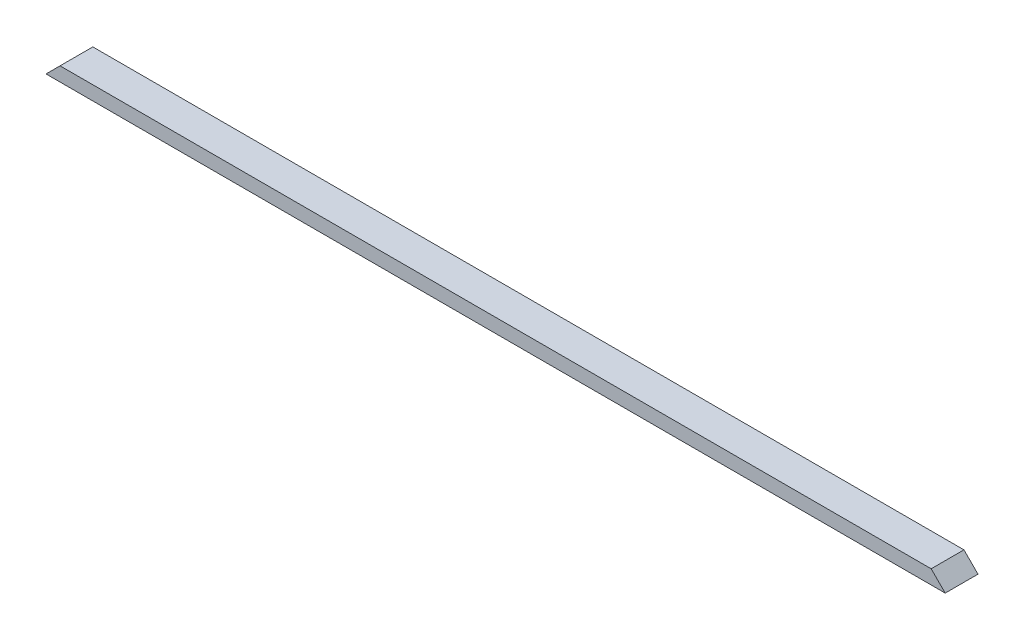
ISO-10303-21;
HEADER;
FILE_DESCRIPTION(('STEP AP214'),'2;1');
FILE_NAME('part.step','',(''),(''),'','','');
FILE_SCHEMA(('AUTOMOTIVE_DESIGN { 1 0 10303 214 1 1 1 1 }'));
ENDSEC;
DATA;
#1=APPLICATION_CONTEXT('core data for automotive mechanical design processes');
#2=APPLICATION_PROTOCOL_DEFINITION('international standard','automotive_design',2000,#1);
#3=PRODUCT_CONTEXT('',#1,'mechanical');
#4=PRODUCT('Part','Part','',(#3));
#5=PRODUCT_RELATED_PRODUCT_CATEGORY('part','',(#4));
#6=PRODUCT_DEFINITION_FORMATION('','',#4);
#7=PRODUCT_DEFINITION_CONTEXT('part definition',#1,'design');
#8=PRODUCT_DEFINITION('design','',#6,#7);
#9=PRODUCT_DEFINITION_SHAPE('','',#8);
#10=(LENGTH_UNIT() NAMED_UNIT(*) SI_UNIT(.MILLI.,.METRE.));
#11=(NAMED_UNIT(*) PLANE_ANGLE_UNIT() SI_UNIT($,.RADIAN.));
#12=(NAMED_UNIT(*) SI_UNIT($,.STERADIAN.) SOLID_ANGLE_UNIT());
#13=UNCERTAINTY_MEASURE_WITH_UNIT(LENGTH_MEASURE(1.E-05),#10,'distance_accuracy_value','');
#14=(GEOMETRIC_REPRESENTATION_CONTEXT(3) GLOBAL_UNCERTAINTY_ASSIGNED_CONTEXT((#13)) GLOBAL_UNIT_ASSIGNED_CONTEXT((#10,
#11,#12)) REPRESENTATION_CONTEXT('',''));
#15=CARTESIAN_POINT('',(0.,0.,0.));
#16=DIRECTION('',(0.,0.,1.));
#17=DIRECTION('',(1.,0.,0.));
#18=AXIS2_PLACEMENT_3D('',#15,#16,#17);
#19=CARTESIAN_POINT('',(0.,38.1,0.));
#20=DIRECTION('',(0.,0.,-1.));
#21=DIRECTION('',(-1.,0.,0.));
#22=AXIS2_PLACEMENT_3D('',#19,#20,#21);
#23=PLANE('',#22);
#24=DIRECTION('',(1.,0.,0.));
#25=VECTOR('',#24,1.);
#26=CARTESIAN_POINT('',(0.,38.1,0.));
#27=LINE('',#26,#25);
#28=CARTESIAN_POINT('',(38.1,38.1,0.));
#29=VERTEX_POINT('',#28);
#30=CARTESIAN_POINT('',(2400.3,38.1,0.));
#31=VERTEX_POINT('',#30);
#32=EDGE_CURVE('E50',#29,#31,#27,.T.);
#33=ORIENTED_EDGE('',*,*,#32,.F.);
#34=DIRECTION('',(0.707106781186547,0.707106781186547,0.));
#35=VECTOR('',#34,1.);
#36=CARTESIAN_POINT('',(0.,0.,0.));
#37=LINE('',#36,#35);
#38=CARTESIAN_POINT('',(0.,0.,0.));
#39=VERTEX_POINT('',#38);
#40=EDGE_CURVE('E85',#39,#29,#37,.T.);
#41=ORIENTED_EDGE('',*,*,#40,.F.);
#42=DIRECTION('',(1.,0.,0.));
#43=VECTOR('',#42,1.);
#44=CARTESIAN_POINT('',(0.,0.,0.));
#45=LINE('',#44,#43);
#46=CARTESIAN_POINT('',(2438.4,0.,0.));
#47=VERTEX_POINT('',#46);
#48=EDGE_CURVE('E91',#39,#47,#45,.T.);
#49=ORIENTED_EDGE('',*,*,#48,.T.);
#50=DIRECTION('',(0.707106781186548,-0.707106781186547,0.));
#51=VECTOR('',#50,1.);
#52=CARTESIAN_POINT('',(2400.3,38.1,0.));
#53=LINE('',#52,#51);
#54=EDGE_CURVE('E66',#31,#47,#53,.T.);
#55=ORIENTED_EDGE('',*,*,#54,.F.);
#56=EDGE_LOOP('',(#33,#41,#49,#55));
#57=FACE_BOUND('',#56,.T.);
#58=ADVANCED_FACE('F41',(#57),#23,.F.);
#59=CARTESIAN_POINT('',(0.,38.1,-88.9));
#60=DIRECTION('',(0.,0.,1.));
#61=DIRECTION('',(1.,0.,0.));
#62=AXIS2_PLACEMENT_3D('',#59,#60,#61);
#63=PLANE('',#62);
#64=DIRECTION('',(-1.,0.,0.));
#65=VECTOR('',#64,1.);
#66=CARTESIAN_POINT('',(0.,0.,-88.9));
#67=LINE('',#66,#65);
#68=CARTESIAN_POINT('',(2438.4,0.,-88.9));
#69=VERTEX_POINT('',#68);
#70=CARTESIAN_POINT('',(0.,0.,-88.9));
#71=VERTEX_POINT('',#70);
#72=EDGE_CURVE('E44',#69,#71,#67,.T.);
#73=ORIENTED_EDGE('',*,*,#72,.T.);
#74=DIRECTION('',(0.707106781186547,0.707106781186547,0.));
#75=VECTOR('',#74,1.);
#76=CARTESIAN_POINT('',(0.,0.,-88.9));
#77=LINE('',#76,#75);
#78=CARTESIAN_POINT('',(38.1,38.1,-88.9));
#79=VERTEX_POINT('',#78);
#80=EDGE_CURVE('E58',#71,#79,#77,.T.);
#81=ORIENTED_EDGE('',*,*,#80,.T.);
#82=DIRECTION('',(-1.,0.,0.));
#83=VECTOR('',#82,1.);
#84=CARTESIAN_POINT('',(0.,38.1,-88.9));
#85=LINE('',#84,#83);
#86=CARTESIAN_POINT('',(2400.3,38.1,-88.9));
#87=VERTEX_POINT('',#86);
#88=EDGE_CURVE('E11',#87,#79,#85,.T.);
#89=ORIENTED_EDGE('',*,*,#88,.F.);
#90=DIRECTION('',(0.707106781186548,-0.707106781186547,0.));
#91=VECTOR('',#90,1.);
#92=CARTESIAN_POINT('',(2400.3,38.1,-88.9));
#93=LINE('',#92,#91);
#94=EDGE_CURVE('E109',#87,#69,#93,.T.);
#95=ORIENTED_EDGE('',*,*,#94,.T.);
#96=EDGE_LOOP('',(#73,#81,#89,#95));
#97=FACE_BOUND('',#96,.T.);
#98=ADVANCED_FACE('F124',(#97),#63,.F.);
#99=CARTESIAN_POINT('',(0.,38.1,0.));
#100=DIRECTION('',(0.,-1.,0.));
#101=DIRECTION('',(0.,0.,-1.));
#102=AXIS2_PLACEMENT_3D('',#99,#100,#101);
#103=PLANE('',#102);
#104=ORIENTED_EDGE('',*,*,#88,.T.);
#105=DIRECTION('',(0.,0.,1.));
#106=VECTOR('',#105,1.);
#107=CARTESIAN_POINT('',(38.1,38.1,-88.9));
#108=LINE('',#107,#106);
#109=EDGE_CURVE('E92',#79,#29,#108,.T.);
#110=ORIENTED_EDGE('',*,*,#109,.T.);
#111=ORIENTED_EDGE('',*,*,#32,.T.);
#112=DIRECTION('',(0.,0.,1.));
#113=VECTOR('',#112,1.);
#114=CARTESIAN_POINT('',(2400.3,38.1,-88.9));
#115=LINE('',#114,#113);
#116=EDGE_CURVE('E113',#87,#31,#115,.T.);
#117=ORIENTED_EDGE('',*,*,#116,.F.);
#118=EDGE_LOOP('',(#104,#110,#111,#117));
#119=FACE_BOUND('',#118,.T.);
#120=ADVANCED_FACE('F127',(#119),#103,.F.);
#121=CARTESIAN_POINT('',(0.,0.,0.));
#122=DIRECTION('',(0.,-1.,0.));
#123=DIRECTION('',(0.,0.,-1.));
#124=AXIS2_PLACEMENT_3D('',#121,#122,#123);
#125=PLANE('',#124);
#126=DIRECTION('',(0.,0.,1.));
#127=VECTOR('',#126,1.);
#128=CARTESIAN_POINT('',(0.,0.,0.));
#129=LINE('',#128,#127);
#130=EDGE_CURVE('E82',#71,#39,#129,.T.);
#131=ORIENTED_EDGE('',*,*,#130,.F.);
#132=ORIENTED_EDGE('',*,*,#72,.F.);
#133=DIRECTION('',(0.,0.,-1.));
#134=VECTOR('',#133,1.);
#135=CARTESIAN_POINT('',(2438.4,0.,0.));
#136=LINE('',#135,#134);
#137=EDGE_CURVE('E101',#47,#69,#136,.T.);
#138=ORIENTED_EDGE('',*,*,#137,.F.);
#139=ORIENTED_EDGE('',*,*,#48,.F.);
#140=EDGE_LOOP('',(#131,#132,#138,#139));
#141=FACE_BOUND('',#140,.T.);
#142=ADVANCED_FACE('F100',(#141),#125,.T.);
#143=CARTESIAN_POINT('',(2400.3,38.1,-88.9));
#144=DIRECTION('',(-0.707106781186547,-0.707106781186548,0.));
#145=DIRECTION('',(0.707106781186548,-0.707106781186547,0.));
#146=AXIS2_PLACEMENT_3D('',#143,#144,#145);
#147=PLANE('',#146);
#148=ORIENTED_EDGE('',*,*,#54,.T.);
#149=ORIENTED_EDGE('',*,*,#137,.T.);
#150=ORIENTED_EDGE('',*,*,#94,.F.);
#151=ORIENTED_EDGE('',*,*,#116,.T.);
#152=EDGE_LOOP('',(#148,#149,#150,#151));
#153=FACE_BOUND('',#152,.T.);
#154=ADVANCED_FACE('F128',(#153),#147,.F.);
#155=CARTESIAN_POINT('',(0.,0.,-88.9));
#156=DIRECTION('',(0.707106781186547,-0.707106781186547,0.));
#157=DIRECTION('',(0.707106781186548,0.707106781186548,0.));
#158=AXIS2_PLACEMENT_3D('',#155,#156,#157);
#159=PLANE('',#158);
#160=ORIENTED_EDGE('',*,*,#40,.T.);
#161=ORIENTED_EDGE('',*,*,#109,.F.);
#162=ORIENTED_EDGE('',*,*,#80,.F.);
#163=ORIENTED_EDGE('',*,*,#130,.T.);
#164=EDGE_LOOP('',(#160,#161,#162,#163));
#165=FACE_BOUND('',#164,.T.);
#166=ADVANCED_FACE('F84',(#165),#159,.F.);
#167=CLOSED_SHELL('',(#58,#98,#120,#142,#154,#166));
#168=MANIFOLD_SOLID_BREP('B2',#167);
#169=ADVANCED_BREP_SHAPE_REPRESENTATION('',(#18,#168),#14);
#170=SHAPE_DEFINITION_REPRESENTATION(#9,#169);
ENDSEC;
END-ISO-10303-21;
